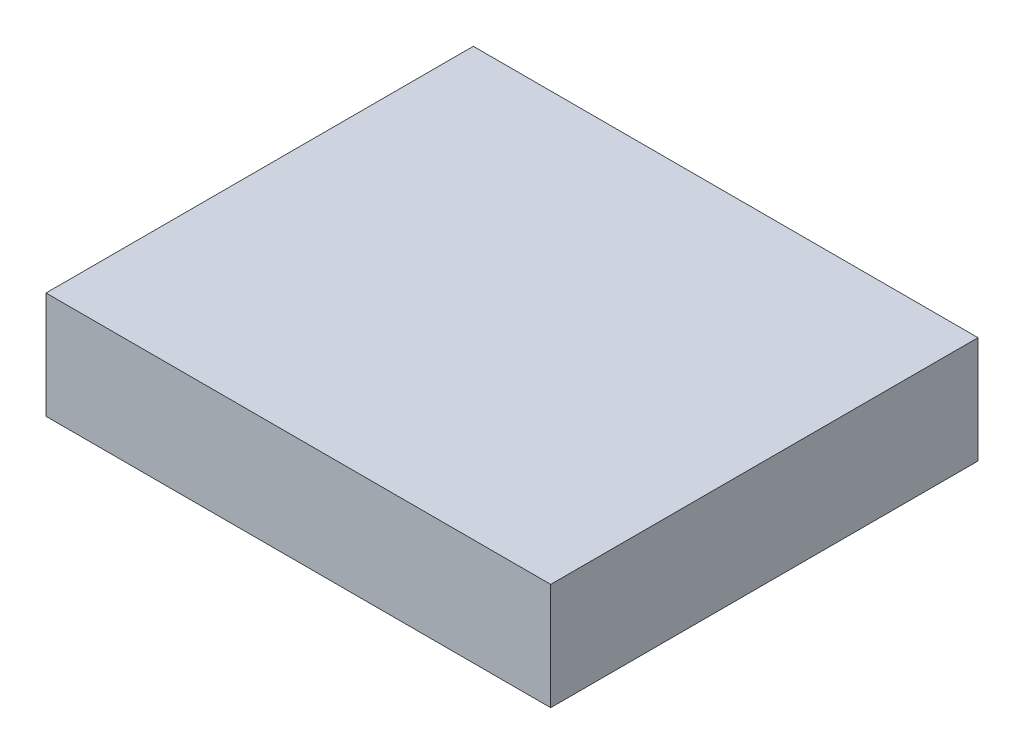
ISO-10303-21;
HEADER;
FILE_DESCRIPTION(('STEP AP214'),'2;1');
FILE_NAME('part.step','',(''),(''),'','','');
FILE_SCHEMA(('AUTOMOTIVE_DESIGN { 1 0 10303 214 1 1 1 1 }'));
ENDSEC;
DATA;
#1=APPLICATION_CONTEXT('core data for automotive mechanical design processes');
#2=APPLICATION_PROTOCOL_DEFINITION('international standard','automotive_design',2000,#1);
#3=PRODUCT_CONTEXT('',#1,'mechanical');
#4=PRODUCT('Part','Part','',(#3));
#5=PRODUCT_RELATED_PRODUCT_CATEGORY('part','',(#4));
#6=PRODUCT_DEFINITION_FORMATION('','',#4);
#7=PRODUCT_DEFINITION_CONTEXT('part definition',#1,'design');
#8=PRODUCT_DEFINITION('design','',#6,#7);
#9=PRODUCT_DEFINITION_SHAPE('','',#8);
#10=(LENGTH_UNIT() NAMED_UNIT(*) SI_UNIT(.MILLI.,.METRE.));
#11=(NAMED_UNIT(*) PLANE_ANGLE_UNIT() SI_UNIT($,.RADIAN.));
#12=(NAMED_UNIT(*) SI_UNIT($,.STERADIAN.) SOLID_ANGLE_UNIT());
#13=UNCERTAINTY_MEASURE_WITH_UNIT(LENGTH_MEASURE(1.E-05),#10,'distance_accuracy_value','');
#14=(GEOMETRIC_REPRESENTATION_CONTEXT(3) GLOBAL_UNCERTAINTY_ASSIGNED_CONTEXT((#13)) GLOBAL_UNIT_ASSIGNED_CONTEXT((#10,
#11,#12)) REPRESENTATION_CONTEXT('',''));
#15=CARTESIAN_POINT('',(0.,0.,0.));
#16=DIRECTION('',(0.,0.,1.));
#17=DIRECTION('',(1.,0.,0.));
#18=AXIS2_PLACEMENT_3D('',#15,#16,#17);
#19=CARTESIAN_POINT('',(0.,-6.35,0.));
#20=DIRECTION('',(-1.,0.,0.));
#21=DIRECTION('',(0.,0.,1.));
#22=AXIS2_PLACEMENT_3D('',#19,#20,#21);
#23=PLANE('',#22);
#24=DIRECTION('',(0.,0.,1.));
#25=VECTOR('',#24,1.);
#26=CARTESIAN_POINT('',(0.,0.,0.));
#27=LINE('',#26,#25);
#28=CARTESIAN_POINT('',(0.,0.,0.));
#29=VERTEX_POINT('',#28);
#30=CARTESIAN_POINT('',(0.,0.,25.4));
#31=VERTEX_POINT('',#30);
#32=EDGE_CURVE('E101',#29,#31,#27,.T.);
#33=ORIENTED_EDGE('',*,*,#32,.F.);
#34=DIRECTION('',(0.,1.,0.));
#35=VECTOR('',#34,1.);
#36=CARTESIAN_POINT('',(0.,-6.35,0.));
#37=LINE('',#36,#35);
#38=CARTESIAN_POINT('',(0.,-6.35,0.));
#39=VERTEX_POINT('',#38);
#40=EDGE_CURVE('E11',#39,#29,#37,.T.);
#41=ORIENTED_EDGE('',*,*,#40,.F.);
#42=DIRECTION('',(0.,0.,1.));
#43=VECTOR('',#42,1.);
#44=CARTESIAN_POINT('',(0.,-6.35,0.));
#45=LINE('',#44,#43);
#46=CARTESIAN_POINT('',(0.,-6.35,25.4));
#47=VERTEX_POINT('',#46);
#48=EDGE_CURVE('E95',#39,#47,#45,.T.);
#49=ORIENTED_EDGE('',*,*,#48,.T.);
#50=DIRECTION('',(0.,1.,0.));
#51=VECTOR('',#50,1.);
#52=CARTESIAN_POINT('',(0.,-6.35,25.4));
#53=LINE('',#52,#51);
#54=EDGE_CURVE('E40',#47,#31,#53,.T.);
#55=ORIENTED_EDGE('',*,*,#54,.T.);
#56=EDGE_LOOP('',(#33,#41,#49,#55));
#57=FACE_BOUND('',#56,.T.);
#58=ADVANCED_FACE('F37',(#57),#23,.T.);
#59=CARTESIAN_POINT('',(0.,-6.35,0.));
#60=DIRECTION('',(0.,0.,-1.));
#61=DIRECTION('',(-1.,0.,0.));
#62=AXIS2_PLACEMENT_3D('',#59,#60,#61);
#63=PLANE('',#62);
#64=DIRECTION('',(-1.,0.,0.));
#65=VECTOR('',#64,1.);
#66=CARTESIAN_POINT('',(0.,0.,0.));
#67=LINE('',#66,#65);
#68=CARTESIAN_POINT('',(30.,0.,0.));
#69=VERTEX_POINT('',#68);
#70=EDGE_CURVE('E97',#69,#29,#67,.T.);
#71=ORIENTED_EDGE('',*,*,#70,.F.);
#72=DIRECTION('',(0.,1.,0.));
#73=VECTOR('',#72,1.);
#74=CARTESIAN_POINT('',(30.,-6.35,0.));
#75=LINE('',#74,#73);
#76=CARTESIAN_POINT('',(30.,-6.35,0.));
#77=VERTEX_POINT('',#76);
#78=EDGE_CURVE('E46',#77,#69,#75,.T.);
#79=ORIENTED_EDGE('',*,*,#78,.F.);
#80=DIRECTION('',(-1.,0.,0.));
#81=VECTOR('',#80,1.);
#82=CARTESIAN_POINT('',(0.,-6.35,0.));
#83=LINE('',#82,#81);
#84=EDGE_CURVE('E92',#77,#39,#83,.T.);
#85=ORIENTED_EDGE('',*,*,#84,.T.);
#86=ORIENTED_EDGE('',*,*,#40,.T.);
#87=EDGE_LOOP('',(#71,#79,#85,#86));
#88=FACE_BOUND('',#87,.T.);
#89=ADVANCED_FACE('F111',(#88),#63,.T.);
#90=CARTESIAN_POINT('',(30.,-6.35,0.));
#91=DIRECTION('',(1.,0.,0.));
#92=DIRECTION('',(0.,0.,-1.));
#93=AXIS2_PLACEMENT_3D('',#90,#91,#92);
#94=PLANE('',#93);
#95=DIRECTION('',(0.,0.,-1.));
#96=VECTOR('',#95,1.);
#97=CARTESIAN_POINT('',(30.,0.,0.));
#98=LINE('',#97,#96);
#99=CARTESIAN_POINT('',(30.,0.,25.4));
#100=VERTEX_POINT('',#99);
#101=EDGE_CURVE('E87',#100,#69,#98,.T.);
#102=ORIENTED_EDGE('',*,*,#101,.F.);
#103=DIRECTION('',(0.,1.,0.));
#104=VECTOR('',#103,1.);
#105=CARTESIAN_POINT('',(30.,-6.35,25.4));
#106=LINE('',#105,#104);
#107=CARTESIAN_POINT('',(30.,-6.35,25.4));
#108=VERTEX_POINT('',#107);
#109=EDGE_CURVE('E82',#108,#100,#106,.T.);
#110=ORIENTED_EDGE('',*,*,#109,.F.);
#111=DIRECTION('',(0.,0.,-1.));
#112=VECTOR('',#111,1.);
#113=CARTESIAN_POINT('',(30.,-6.35,0.));
#114=LINE('',#113,#112);
#115=EDGE_CURVE('E85',#108,#77,#114,.T.);
#116=ORIENTED_EDGE('',*,*,#115,.T.);
#117=ORIENTED_EDGE('',*,*,#78,.T.);
#118=EDGE_LOOP('',(#102,#110,#116,#117));
#119=FACE_BOUND('',#118,.T.);
#120=ADVANCED_FACE('F84',(#119),#94,.T.);
#121=CARTESIAN_POINT('',(0.,-6.35,25.4));
#122=DIRECTION('',(0.,0.,1.));
#123=DIRECTION('',(1.,0.,0.));
#124=AXIS2_PLACEMENT_3D('',#121,#122,#123);
#125=PLANE('',#124);
#126=DIRECTION('',(1.,0.,0.));
#127=VECTOR('',#126,1.);
#128=CARTESIAN_POINT('',(0.,0.,25.4));
#129=LINE('',#128,#127);
#130=EDGE_CURVE('E104',#31,#100,#129,.T.);
#131=ORIENTED_EDGE('',*,*,#130,.F.);
#132=ORIENTED_EDGE('',*,*,#54,.F.);
#133=DIRECTION('',(1.,0.,0.));
#134=VECTOR('',#133,1.);
#135=CARTESIAN_POINT('',(0.,-6.35,25.4));
#136=LINE('',#135,#134);
#137=EDGE_CURVE('E91',#47,#108,#136,.T.);
#138=ORIENTED_EDGE('',*,*,#137,.T.);
#139=ORIENTED_EDGE('',*,*,#109,.T.);
#140=EDGE_LOOP('',(#131,#132,#138,#139));
#141=FACE_BOUND('',#140,.T.);
#142=ADVANCED_FACE('F94',(#141),#125,.T.);
#143=CARTESIAN_POINT('',(0.,-6.35,0.));
#144=DIRECTION('',(0.,1.,0.));
#145=DIRECTION('',(0.,0.,1.));
#146=AXIS2_PLACEMENT_3D('',#143,#144,#145);
#147=PLANE('',#146);
#148=ORIENTED_EDGE('',*,*,#48,.F.);
#149=ORIENTED_EDGE('',*,*,#84,.F.);
#150=ORIENTED_EDGE('',*,*,#115,.F.);
#151=ORIENTED_EDGE('',*,*,#137,.F.);
#152=EDGE_LOOP('',(#148,#149,#150,#151));
#153=FACE_BOUND('',#152,.T.);
#154=ADVANCED_FACE('F90',(#153),#147,.F.);
#155=CARTESIAN_POINT('',(0.,0.,0.));
#156=DIRECTION('',(0.,1.,0.));
#157=DIRECTION('',(0.,0.,1.));
#158=AXIS2_PLACEMENT_3D('',#155,#156,#157);
#159=PLANE('',#158);
#160=ORIENTED_EDGE('',*,*,#32,.T.);
#161=ORIENTED_EDGE('',*,*,#130,.T.);
#162=ORIENTED_EDGE('',*,*,#101,.T.);
#163=ORIENTED_EDGE('',*,*,#70,.T.);
#164=EDGE_LOOP('',(#160,#161,#162,#163));
#165=FACE_BOUND('',#164,.T.);
#166=ADVANCED_FACE('F110',(#165),#159,.T.);
#167=CLOSED_SHELL('',(#58,#89,#120,#142,#154,#166));
#168=MANIFOLD_SOLID_BREP('B2',#167);
#169=ADVANCED_BREP_SHAPE_REPRESENTATION('',(#18,#168),#14);
#170=SHAPE_DEFINITION_REPRESENTATION(#9,#169);
ENDSEC;
END-ISO-10303-21;
